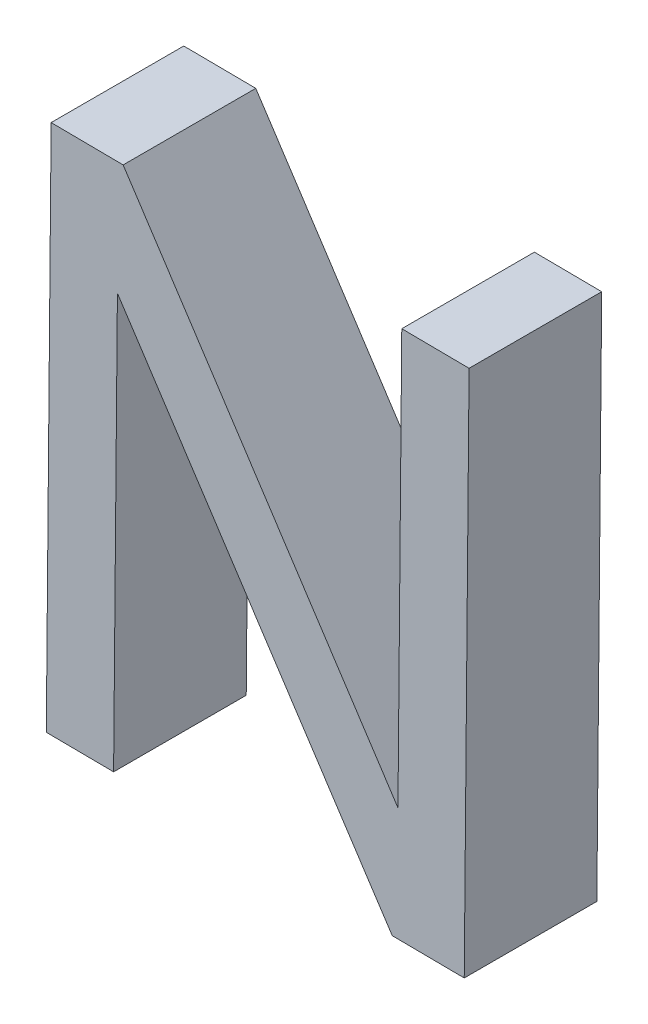
ISO-10303-21;
HEADER;
FILE_DESCRIPTION(('STEP AP214'),'2;1');
FILE_NAME('part.step','',(''),(''),'','','');
FILE_SCHEMA(('AUTOMOTIVE_DESIGN { 1 0 10303 214 1 1 1 1 }'));
ENDSEC;
DATA;
#1=APPLICATION_CONTEXT('core data for automotive mechanical design processes');
#2=APPLICATION_PROTOCOL_DEFINITION('international standard','automotive_design',2000,#1);
#3=PRODUCT_CONTEXT('',#1,'mechanical');
#4=PRODUCT('Part','Part','',(#3));
#5=PRODUCT_RELATED_PRODUCT_CATEGORY('part','',(#4));
#6=PRODUCT_DEFINITION_FORMATION('','',#4);
#7=PRODUCT_DEFINITION_CONTEXT('part definition',#1,'design');
#8=PRODUCT_DEFINITION('design','',#6,#7);
#9=PRODUCT_DEFINITION_SHAPE('','',#8);
#10=(LENGTH_UNIT() NAMED_UNIT(*) SI_UNIT(.MILLI.,.METRE.));
#11=(NAMED_UNIT(*) PLANE_ANGLE_UNIT() SI_UNIT($,.RADIAN.));
#12=(NAMED_UNIT(*) SI_UNIT($,.STERADIAN.) SOLID_ANGLE_UNIT());
#13=UNCERTAINTY_MEASURE_WITH_UNIT(LENGTH_MEASURE(1.E-05),#10,'distance_accuracy_value','');
#14=(GEOMETRIC_REPRESENTATION_CONTEXT(3) GLOBAL_UNCERTAINTY_ASSIGNED_CONTEXT((#13)) GLOBAL_UNIT_ASSIGNED_CONTEXT((#10,
#11,#12)) REPRESENTATION_CONTEXT('',''));
#15=CARTESIAN_POINT('',(0.,0.,0.));
#16=DIRECTION('',(0.,0.,1.));
#17=DIRECTION('',(1.,0.,0.));
#18=AXIS2_PLACEMENT_3D('',#15,#16,#17);
#19=CARTESIAN_POINT('',(2.35461573676656,7.63554233680784,0.));
#20=DIRECTION('',(0.836427040850058,0.54807828394748,0.));
#21=DIRECTION('',(0.,0.,-1.));
#22=AXIS2_PLACEMENT_3D('',#19,#20,#21);
#23=PLANE('',#22);
#24=DIRECTION('',(0.54807828394748,-0.836427040850058,0.));
#25=VECTOR('',#24,1.);
#26=CARTESIAN_POINT('',(1.83658003302368,8.42612113444882,0.));
#27=LINE('',#26,#25);
#28=CARTESIAN_POINT('',(1.83658003302368,8.42612113444882,0.));
#29=VERTEX_POINT('',#28);
#30=CARTESIAN_POINT('',(2.35461573676656,7.63554233680784,0.));
#31=VERTEX_POINT('',#30);
#32=EDGE_CURVE('E139',#29,#31,#27,.T.);
#33=ORIENTED_EDGE('',*,*,#32,.F.);
#34=DIRECTION('',(0.,0.,1.));
#35=VECTOR('',#34,1.);
#36=CARTESIAN_POINT('',(1.83658003302368,8.42612113444882,0.));
#37=LINE('',#36,#35);
#38=CARTESIAN_POINT('',(1.83658003302368,8.42612113444882,0.25));
#39=VERTEX_POINT('',#38);
#40=EDGE_CURVE('E11',#29,#39,#37,.T.);
#41=ORIENTED_EDGE('',*,*,#40,.T.);
#42=DIRECTION('',(-0.54807828394748,0.836427040850058,0.));
#43=VECTOR('',#42,1.);
#44=CARTESIAN_POINT('',(1.83658003302368,8.42612113444882,0.25));
#45=LINE('',#44,#43);
#46=CARTESIAN_POINT('',(2.35461573676656,7.63554233680784,0.25));
#47=VERTEX_POINT('',#46);
#48=EDGE_CURVE('E217',#47,#39,#45,.T.);
#49=ORIENTED_EDGE('',*,*,#48,.F.);
#50=DIRECTION('',(0.,0.,1.));
#51=VECTOR('',#50,1.);
#52=CARTESIAN_POINT('',(2.35461573676656,7.63554233680784,0.));
#53=LINE('',#52,#51);
#54=EDGE_CURVE('E143',#31,#47,#53,.T.);
#55=ORIENTED_EDGE('',*,*,#54,.F.);
#56=EDGE_LOOP('',(#33,#41,#49,#55));
#57=FACE_BOUND('',#56,.T.);
#58=ADVANCED_FACE('F16',(#57),#23,.T.);
#59=CARTESIAN_POINT('',(2.34379105637571,7.42144399602863,0.));
#60=DIRECTION('',(-0.00913854515184054,-0.999958242624415,0.));
#61=DIRECTION('',(-0.999958242624415,0.00913854515184054,0.));
#62=AXIS2_PLACEMENT_3D('',#59,#60,#61);
#63=PLANE('',#62);
#64=DIRECTION('',(-0.999958242624415,0.00913854515184054,0.));
#65=VECTOR('',#64,1.);
#66=CARTESIAN_POINT('',(2.47952885708455,7.42020349820811,0.));
#67=LINE('',#66,#65);
#68=CARTESIAN_POINT('',(2.47952885708455,7.42020349820811,0.));
#69=VERTEX_POINT('',#68);
#70=CARTESIAN_POINT('',(2.34379105637571,7.42144399602863,0.));
#71=VERTEX_POINT('',#70);
#72=EDGE_CURVE('E20',#69,#71,#67,.T.);
#73=ORIENTED_EDGE('',*,*,#72,.F.);
#74=DIRECTION('',(0.,0.,1.));
#75=VECTOR('',#74,1.);
#76=CARTESIAN_POINT('',(2.47952885708455,7.42020349820811,0.));
#77=LINE('',#76,#75);
#78=CARTESIAN_POINT('',(2.47952885708455,7.42020349820811,0.25));
#79=VERTEX_POINT('',#78);
#80=EDGE_CURVE('E41',#69,#79,#77,.T.);
#81=ORIENTED_EDGE('',*,*,#80,.T.);
#82=DIRECTION('',(0.999958242624415,-0.00913854515184054,0.));
#83=VECTOR('',#82,1.);
#84=CARTESIAN_POINT('',(2.47952885708455,7.42020349820811,0.25));
#85=LINE('',#84,#83);
#86=CARTESIAN_POINT('',(2.34379105637571,7.42144399602863,0.25));
#87=VERTEX_POINT('',#86);
#88=EDGE_CURVE('E149',#87,#79,#85,.T.);
#89=ORIENTED_EDGE('',*,*,#88,.F.);
#90=DIRECTION('',(0.,0.,1.));
#91=VECTOR('',#90,1.);
#92=CARTESIAN_POINT('',(2.34379105637571,7.42144399602863,0.));
#93=LINE('',#92,#91);
#94=EDGE_CURVE('E27',#71,#87,#93,.T.);
#95=ORIENTED_EDGE('',*,*,#94,.F.);
#96=EDGE_LOOP('',(#73,#81,#89,#95));
#97=FACE_BOUND('',#96,.T.);
#98=ADVANCED_FACE('F330',(#97),#63,.T.);
#99=CARTESIAN_POINT('',(1.83658003302368,8.42612113444882,0.));
#100=DIRECTION('',(0.00913854515184054,0.999958242624415,0.));
#101=DIRECTION('',(0.,0.,-1.));
#102=AXIS2_PLACEMENT_3D('',#99,#100,#101);
#103=PLANE('',#102);
#104=DIRECTION('',(0.999958242624415,-0.00913854515184054,0.));
#105=VECTOR('',#104,1.);
#106=CARTESIAN_POINT('',(1.70084223231484,8.42736163226934,0.));
#107=LINE('',#106,#105);
#108=CARTESIAN_POINT('',(1.70084223231484,8.42736163226934,0.));
#109=VERTEX_POINT('',#108);
#110=EDGE_CURVE('E136',#109,#29,#107,.T.);
#111=ORIENTED_EDGE('',*,*,#110,.F.);
#112=DIRECTION('',(0.,0.,1.));
#113=VECTOR('',#112,1.);
#114=CARTESIAN_POINT('',(1.70084223231484,8.42736163226934,0.));
#115=LINE('',#114,#113);
#116=CARTESIAN_POINT('',(1.70084223231484,8.42736163226934,0.25));
#117=VERTEX_POINT('',#116);
#118=EDGE_CURVE('E107',#109,#117,#115,.T.);
#119=ORIENTED_EDGE('',*,*,#118,.T.);
#120=DIRECTION('',(-0.999958242624415,0.00913854515184054,0.));
#121=VECTOR('',#120,1.);
#122=CARTESIAN_POINT('',(1.70084223231484,8.42736163226934,0.25));
#123=LINE('',#122,#121);
#124=EDGE_CURVE('E102',#39,#117,#123,.T.);
#125=ORIENTED_EDGE('',*,*,#124,.F.);
#126=ORIENTED_EDGE('',*,*,#40,.F.);
#127=EDGE_LOOP('',(#111,#119,#125,#126));
#128=FACE_BOUND('',#127,.T.);
#129=ADVANCED_FACE('F320',(#128),#103,.T.);
#130=CARTESIAN_POINT('',(1.82574911922521,8.2113407214987,0.));
#131=DIRECTION('',(-0.836207048672655,-0.54841386903521,0.));
#132=DIRECTION('',(-0.54841386903521,0.836207048672655,0.));
#133=AXIS2_PLACEMENT_3D('',#130,#131,#132);
#134=PLANE('',#133);
#135=DIRECTION('',(-0.54841386903521,0.836207048672655,0.));
#136=VECTOR('',#135,1.);
#137=CARTESIAN_POINT('',(2.34379105637571,7.42144399602863,0.));
#138=LINE('',#137,#136);
#139=CARTESIAN_POINT('',(1.82574911922521,8.2113407214987,0.));
#140=VERTEX_POINT('',#139);
#141=EDGE_CURVE('E140',#71,#140,#138,.T.);
#142=ORIENTED_EDGE('',*,*,#141,.F.);
#143=ORIENTED_EDGE('',*,*,#94,.T.);
#144=DIRECTION('',(0.54841386903521,-0.836207048672655,0.));
#145=VECTOR('',#144,1.);
#146=CARTESIAN_POINT('',(2.34379105637571,7.42144399602863,0.25));
#147=LINE('',#146,#145);
#148=CARTESIAN_POINT('',(1.82574911922521,8.2113407214987,0.25));
#149=VERTEX_POINT('',#148);
#150=EDGE_CURVE('E154',#149,#87,#147,.T.);
#151=ORIENTED_EDGE('',*,*,#150,.F.);
#152=DIRECTION('',(0.,0.,1.));
#153=VECTOR('',#152,1.);
#154=CARTESIAN_POINT('',(1.82574911922521,8.2113407214987,0.));
#155=LINE('',#154,#153);
#156=EDGE_CURVE('E144',#140,#149,#155,.T.);
#157=ORIENTED_EDGE('',*,*,#156,.F.);
#158=EDGE_LOOP('',(#142,#143,#151,#157));
#159=FACE_BOUND('',#158,.T.);
#160=ADVANCED_FACE('F314',(#159),#134,.T.);
#161=CARTESIAN_POINT('',(2.3617969123991,8.42132121585013,0.));
#162=DIRECTION('',(-0.999958242624415,0.00913854515184318,0.));
#163=DIRECTION('',(0.,0.,1.));
#164=AXIS2_PLACEMENT_3D('',#161,#162,#163);
#165=PLANE('',#164);
#166=DIRECTION('',(0.00913854515184318,0.999958242624415,0.));
#167=VECTOR('',#166,1.);
#168=CARTESIAN_POINT('',(2.35461573676656,7.63554233680784,0.));
#169=LINE('',#168,#167);
#170=CARTESIAN_POINT('',(2.3617969123991,8.42132121585013,0.));
#171=VERTEX_POINT('',#170);
#172=EDGE_CURVE('E155',#31,#171,#169,.T.);
#173=ORIENTED_EDGE('',*,*,#172,.F.);
#174=ORIENTED_EDGE('',*,*,#54,.T.);
#175=DIRECTION('',(-0.00913854515184318,-0.999958242624415,0.));
#176=VECTOR('',#175,1.);
#177=CARTESIAN_POINT('',(2.35461573676656,7.63554233680784,0.25));
#178=LINE('',#177,#176);
#179=CARTESIAN_POINT('',(2.3617969123991,8.42132121585013,0.25));
#180=VERTEX_POINT('',#179);
#181=EDGE_CURVE('E165',#180,#47,#178,.T.);
#182=ORIENTED_EDGE('',*,*,#181,.F.);
#183=DIRECTION('',(0.,0.,1.));
#184=VECTOR('',#183,1.);
#185=CARTESIAN_POINT('',(2.3617969123991,8.42132121585013,0.));
#186=LINE('',#185,#184);
#187=EDGE_CURVE('E193',#171,#180,#186,.T.);
#188=ORIENTED_EDGE('',*,*,#187,.F.);
#189=EDGE_LOOP('',(#173,#174,#182,#188));
#190=FACE_BOUND('',#189,.T.);
#191=ADVANCED_FACE('F319',(#190),#165,.T.);
#192=CARTESIAN_POINT('',(2.48866740237257,8.42016175573306,0.));
#193=DIRECTION('',(0.00913854515184272,0.999958242624415,0.));
#194=DIRECTION('',(0.,0.,-1.));
#195=AXIS2_PLACEMENT_3D('',#192,#193,#194);
#196=PLANE('',#195);
#197=DIRECTION('',(0.999958242624415,-0.00913854515184272,0.));
#198=VECTOR('',#197,1.);
#199=CARTESIAN_POINT('',(2.3617969123991,8.42132121585013,0.));
#200=LINE('',#199,#198);
#201=CARTESIAN_POINT('',(2.48866740237257,8.42016175573306,0.));
#202=VERTEX_POINT('',#201);
#203=EDGE_CURVE('E172',#171,#202,#200,.T.);
#204=ORIENTED_EDGE('',*,*,#203,.F.);
#205=ORIENTED_EDGE('',*,*,#187,.T.);
#206=DIRECTION('',(-0.999958242624415,0.00913854515184272,0.));
#207=VECTOR('',#206,1.);
#208=CARTESIAN_POINT('',(2.3617969123991,8.42132121585013,0.25));
#209=LINE('',#208,#207);
#210=CARTESIAN_POINT('',(2.48866740237257,8.42016175573306,0.25));
#211=VERTEX_POINT('',#210);
#212=EDGE_CURVE('E159',#211,#180,#209,.T.);
#213=ORIENTED_EDGE('',*,*,#212,.F.);
#214=DIRECTION('',(0.,0.,1.));
#215=VECTOR('',#214,1.);
#216=CARTESIAN_POINT('',(2.48866740237257,8.42016175573306,0.));
#217=LINE('',#216,#215);
#218=EDGE_CURVE('E168',#202,#211,#217,.T.);
#219=ORIENTED_EDGE('',*,*,#218,.F.);
#220=EDGE_LOOP('',(#204,#205,#213,#219));
#221=FACE_BOUND('',#220,.T.);
#222=ADVANCED_FACE('F372',(#221),#196,.T.);
#223=CARTESIAN_POINT('',(2.47952885708455,7.42020349820811,0.));
#224=DIRECTION('',(0.999958242624415,-0.00913854515184334,0.));
#225=DIRECTION('',(0.,0.,-1.));
#226=AXIS2_PLACEMENT_3D('',#223,#224,#225);
#227=PLANE('',#226);
#228=DIRECTION('',(-0.00913854515184334,-0.999958242624415,0.));
#229=VECTOR('',#228,1.);
#230=CARTESIAN_POINT('',(2.48866740237257,8.42016175573306,0.));
#231=LINE('',#230,#229);
#232=EDGE_CURVE('E169',#202,#69,#231,.T.);
#233=ORIENTED_EDGE('',*,*,#232,.F.);
#234=ORIENTED_EDGE('',*,*,#218,.T.);
#235=DIRECTION('',(0.00913854515184334,0.999958242624415,0.));
#236=VECTOR('',#235,1.);
#237=CARTESIAN_POINT('',(2.48866740237257,8.42016175573306,0.25));
#238=LINE('',#237,#236);
#239=EDGE_CURVE('E153',#79,#211,#238,.T.);
#240=ORIENTED_EDGE('',*,*,#239,.F.);
#241=ORIENTED_EDGE('',*,*,#80,.F.);
#242=EDGE_LOOP('',(#233,#234,#240,#241));
#243=FACE_BOUND('',#242,.T.);
#244=ADVANCED_FACE('F383',(#243),#227,.T.);
#245=CARTESIAN_POINT('',(0.0434994918093968,7.94596675152105,0.25));
#246=DIRECTION('',(0.,0.,1.));
#247=DIRECTION('',(1.,0.,0.));
#248=AXIS2_PLACEMENT_3D('',#245,#246,#247);
#249=PLANE('',#248);
#250=ORIENTED_EDGE('',*,*,#212,.T.);
#251=ORIENTED_EDGE('',*,*,#181,.T.);
#252=ORIENTED_EDGE('',*,*,#48,.T.);
#253=ORIENTED_EDGE('',*,*,#124,.T.);
#254=DIRECTION('',(-0.00913854515184334,-0.999958242624415,0.));
#255=VECTOR('',#254,1.);
#256=CARTESIAN_POINT('',(1.69170368702682,7.42740337474439,0.25));
#257=LINE('',#256,#255);
#258=CARTESIAN_POINT('',(1.69170368702682,7.42740337474439,0.25));
#259=VERTEX_POINT('',#258);
#260=EDGE_CURVE('E92',#117,#259,#257,.T.);
#261=ORIENTED_EDGE('',*,*,#260,.T.);
#262=DIRECTION('',(0.999958242624415,-0.00913854515184272,0.));
#263=VECTOR('',#262,1.);
#264=CARTESIAN_POINT('',(1.81857417700029,7.42624391462732,0.25));
#265=LINE('',#264,#263);
#266=CARTESIAN_POINT('',(1.81857417700029,7.42624391462732,0.25));
#267=VERTEX_POINT('',#266);
#268=EDGE_CURVE('E97',#259,#267,#265,.T.);
#269=ORIENTED_EDGE('',*,*,#268,.T.);
#270=DIRECTION('',(0.0091385451518432,0.999958242624415,0.));
#271=VECTOR('',#270,1.);
#272=CARTESIAN_POINT('',(1.82574911922521,8.21134072149869,0.25));
#273=LINE('',#272,#271);
#274=EDGE_CURVE('E148',#267,#149,#273,.T.);
#275=ORIENTED_EDGE('',*,*,#274,.T.);
#276=ORIENTED_EDGE('',*,*,#150,.T.);
#277=ORIENTED_EDGE('',*,*,#88,.T.);
#278=ORIENTED_EDGE('',*,*,#239,.T.);
#279=EDGE_LOOP('',(#250,#251,#252,#253,#261,#269,#275,#276,#277,#278));
#280=FACE_BOUND('',#279,.T.);
#281=ADVANCED_FACE('F18',(#280),#249,.T.);
#282=CARTESIAN_POINT('',(0.0434994918093968,7.94596675152105,0.));
#283=DIRECTION('',(0.,0.,1.));
#284=DIRECTION('',(1.,0.,0.));
#285=AXIS2_PLACEMENT_3D('',#282,#283,#284);
#286=PLANE('',#285);
#287=ORIENTED_EDGE('',*,*,#203,.T.);
#288=ORIENTED_EDGE('',*,*,#232,.T.);
#289=ORIENTED_EDGE('',*,*,#72,.T.);
#290=ORIENTED_EDGE('',*,*,#141,.T.);
#291=DIRECTION('',(-0.0091385451518432,-0.999958242624415,0.));
#292=VECTOR('',#291,1.);
#293=CARTESIAN_POINT('',(1.82574911922521,8.21134072149869,0.));
#294=LINE('',#293,#292);
#295=CARTESIAN_POINT('',(1.81857417700029,7.42624391462732,0.));
#296=VERTEX_POINT('',#295);
#297=EDGE_CURVE('E118',#140,#296,#294,.T.);
#298=ORIENTED_EDGE('',*,*,#297,.T.);
#299=DIRECTION('',(-0.999958242624415,0.00913854515184272,0.));
#300=VECTOR('',#299,1.);
#301=CARTESIAN_POINT('',(1.81857417700029,7.42624391462732,0.));
#302=LINE('',#301,#300);
#303=CARTESIAN_POINT('',(1.69170368702682,7.42740337474439,0.));
#304=VERTEX_POINT('',#303);
#305=EDGE_CURVE('E131',#296,#304,#302,.T.);
#306=ORIENTED_EDGE('',*,*,#305,.T.);
#307=DIRECTION('',(0.00913854515184334,0.999958242624415,0.));
#308=VECTOR('',#307,1.);
#309=CARTESIAN_POINT('',(1.69170368702682,7.42740337474439,0.));
#310=LINE('',#309,#308);
#311=EDGE_CURVE('E108',#304,#109,#310,.T.);
#312=ORIENTED_EDGE('',*,*,#311,.T.);
#313=ORIENTED_EDGE('',*,*,#110,.T.);
#314=ORIENTED_EDGE('',*,*,#32,.T.);
#315=ORIENTED_EDGE('',*,*,#172,.T.);
#316=EDGE_LOOP('',(#287,#288,#289,#290,#298,#306,#312,#313,#314,#315));
#317=FACE_BOUND('',#316,.T.);
#318=ADVANCED_FACE('F202',(#317),#286,.F.);
#319=CARTESIAN_POINT('',(1.70084223231484,8.42736163226934,0.));
#320=DIRECTION('',(-0.999958242624415,0.00913854515184334,0.));
#321=DIRECTION('',(0.,0.,1.));
#322=AXIS2_PLACEMENT_3D('',#319,#320,#321);
#323=PLANE('',#322);
#324=ORIENTED_EDGE('',*,*,#311,.F.);
#325=DIRECTION('',(0.,0.,1.));
#326=VECTOR('',#325,1.);
#327=CARTESIAN_POINT('',(1.69170368702682,7.42740337474439,0.));
#328=LINE('',#327,#326);
#329=EDGE_CURVE('E111',#304,#259,#328,.T.);
#330=ORIENTED_EDGE('',*,*,#329,.T.);
#331=ORIENTED_EDGE('',*,*,#260,.F.);
#332=ORIENTED_EDGE('',*,*,#118,.F.);
#333=EDGE_LOOP('',(#324,#330,#331,#332));
#334=FACE_BOUND('',#333,.T.);
#335=ADVANCED_FACE('F112',(#334),#323,.T.);
#336=CARTESIAN_POINT('',(1.81857417700029,7.42624391462732,0.));
#337=DIRECTION('',(0.999958242624415,-0.0091385451518432,0.));
#338=DIRECTION('',(0.,0.,-1.));
#339=AXIS2_PLACEMENT_3D('',#336,#337,#338);
#340=PLANE('',#339);
#341=ORIENTED_EDGE('',*,*,#297,.F.);
#342=ORIENTED_EDGE('',*,*,#156,.T.);
#343=ORIENTED_EDGE('',*,*,#274,.F.);
#344=DIRECTION('',(0.,0.,1.));
#345=VECTOR('',#344,1.);
#346=CARTESIAN_POINT('',(1.81857417700029,7.42624391462732,0.));
#347=LINE('',#346,#345);
#348=EDGE_CURVE('E122',#296,#267,#347,.T.);
#349=ORIENTED_EDGE('',*,*,#348,.F.);
#350=EDGE_LOOP('',(#341,#342,#343,#349));
#351=FACE_BOUND('',#350,.T.);
#352=ADVANCED_FACE('F208',(#351),#340,.T.);
#353=CARTESIAN_POINT('',(1.69170368702682,7.42740337474439,0.));
#354=DIRECTION('',(-0.00913854515184272,-0.999958242624415,0.));
#355=DIRECTION('',(-0.999958242624415,0.00913854515184272,0.));
#356=AXIS2_PLACEMENT_3D('',#353,#354,#355);
#357=PLANE('',#356);
#358=ORIENTED_EDGE('',*,*,#305,.F.);
#359=ORIENTED_EDGE('',*,*,#348,.T.);
#360=ORIENTED_EDGE('',*,*,#268,.F.);
#361=ORIENTED_EDGE('',*,*,#329,.F.);
#362=EDGE_LOOP('',(#358,#359,#360,#361));
#363=FACE_BOUND('',#362,.T.);
#364=ADVANCED_FACE('F120',(#363),#357,.T.);
#365=CLOSED_SHELL('',(#58,#98,#129,#160,#191,#222,#244,#281,#318,#335,#352,#364));
#366=MANIFOLD_SOLID_BREP('B1',#365);
#367=ADVANCED_BREP_SHAPE_REPRESENTATION('',(#18,#366),#14);
#368=SHAPE_DEFINITION_REPRESENTATION(#9,#367);
ENDSEC;
END-ISO-10303-21;
